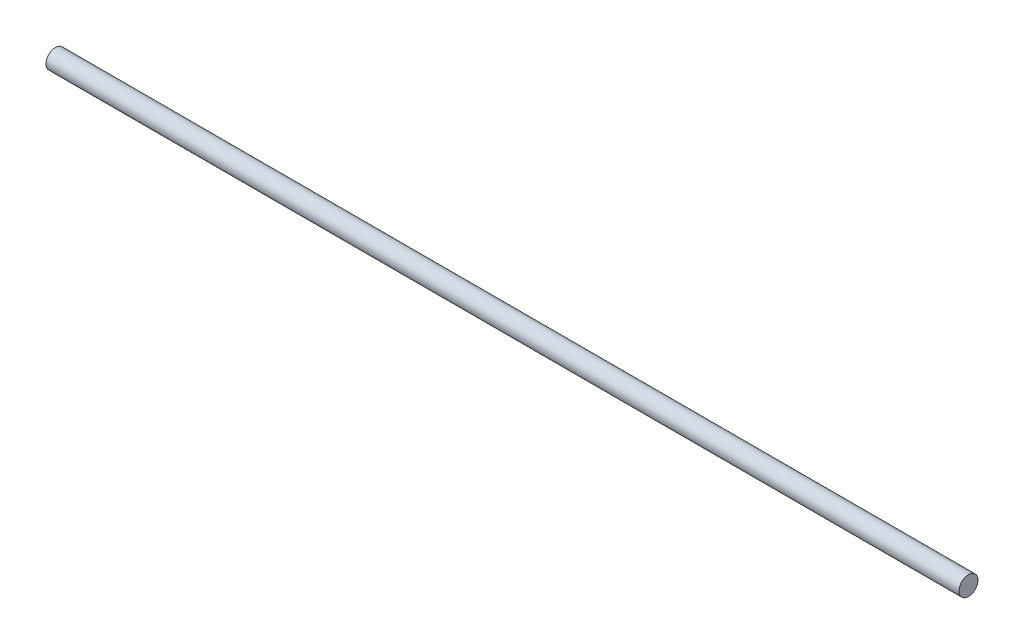
ISO-10303-21;
HEADER;
FILE_DESCRIPTION(('STEP AP214'),'2;1');
FILE_NAME('part.step','',(''),(''),'','','');
FILE_SCHEMA(('AUTOMOTIVE_DESIGN { 1 0 10303 214 1 1 1 1 }'));
ENDSEC;
DATA;
#1=APPLICATION_CONTEXT('core data for automotive mechanical design processes');
#2=APPLICATION_PROTOCOL_DEFINITION('international standard','automotive_design',2000,#1);
#3=PRODUCT_CONTEXT('',#1,'mechanical');
#4=PRODUCT('Part','Part','',(#3));
#5=PRODUCT_RELATED_PRODUCT_CATEGORY('part','',(#4));
#6=PRODUCT_DEFINITION_FORMATION('','',#4);
#7=PRODUCT_DEFINITION_CONTEXT('part definition',#1,'design');
#8=PRODUCT_DEFINITION('design','',#6,#7);
#9=PRODUCT_DEFINITION_SHAPE('','',#8);
#10=(LENGTH_UNIT() NAMED_UNIT(*) SI_UNIT(.MILLI.,.METRE.));
#11=(NAMED_UNIT(*) PLANE_ANGLE_UNIT() SI_UNIT($,.RADIAN.));
#12=(NAMED_UNIT(*) SI_UNIT($,.STERADIAN.) SOLID_ANGLE_UNIT());
#13=UNCERTAINTY_MEASURE_WITH_UNIT(LENGTH_MEASURE(1.E-05),#10,'distance_accuracy_value','');
#14=(GEOMETRIC_REPRESENTATION_CONTEXT(3) GLOBAL_UNCERTAINTY_ASSIGNED_CONTEXT((#13)) GLOBAL_UNIT_ASSIGNED_CONTEXT((#10,
#11,#12)) REPRESENTATION_CONTEXT('',''));
#15=CARTESIAN_POINT('',(0.,0.,0.));
#16=DIRECTION('',(0.,0.,1.));
#17=DIRECTION('',(1.,0.,0.));
#18=AXIS2_PLACEMENT_3D('',#15,#16,#17);
#19=CARTESIAN_POINT('',(304.8,0.,0.));
#20=DIRECTION('',(-1.,0.,0.));
#21=DIRECTION('',(0.,0.,1.));
#22=AXIS2_PLACEMENT_3D('',#19,#20,#21);
#23=CYLINDRICAL_SURFACE('',#22,3.175);
#24=CARTESIAN_POINT('',(304.8,0.,0.));
#25=DIRECTION('',(1.,0.,0.));
#26=DIRECTION('',(0.,0.,-1.));
#27=AXIS2_PLACEMENT_3D('',#24,#25,#26);
#28=CIRCLE('',#27,3.175);
#29=CARTESIAN_POINT('',(304.8,0.,-3.175));
#30=VERTEX_POINT('',#29);
#31=EDGE_CURVE('E10',#30,#30,#28,.T.);
#32=ORIENTED_EDGE('',*,*,#31,.F.);
#33=EDGE_LOOP('',(#32));
#34=FACE_BOUND('',#33,.T.);
#35=CARTESIAN_POINT('',(0.,0.,0.));
#36=DIRECTION('',(1.,0.,0.));
#37=DIRECTION('',(0.,0.,-1.));
#38=AXIS2_PLACEMENT_3D('',#35,#36,#37);
#39=CIRCLE('',#38,3.175);
#40=CARTESIAN_POINT('',(0.,0.,-3.175));
#41=VERTEX_POINT('',#40);
#42=EDGE_CURVE('E40',#41,#41,#39,.T.);
#43=ORIENTED_EDGE('',*,*,#42,.T.);
#44=EDGE_LOOP('',(#43));
#45=FACE_BOUND('',#44,.T.);
#46=ADVANCED_FACE('F37',(#34,#45),#23,.T.);
#47=CARTESIAN_POINT('',(304.8,0.,0.));
#48=DIRECTION('',(1.,0.,0.));
#49=DIRECTION('',(0.,0.,-1.));
#50=AXIS2_PLACEMENT_3D('',#47,#48,#49);
#51=PLANE('',#50);
#52=ORIENTED_EDGE('',*,*,#31,.T.);
#53=EDGE_LOOP('',(#52));
#54=FACE_BOUND('',#53,.T.);
#55=ADVANCED_FACE('F52',(#54),#51,.T.);
#56=CARTESIAN_POINT('',(0.,0.,0.));
#57=DIRECTION('',(1.,0.,0.));
#58=DIRECTION('',(0.,0.,-1.));
#59=AXIS2_PLACEMENT_3D('',#56,#57,#58);
#60=PLANE('',#59);
#61=ORIENTED_EDGE('',*,*,#42,.F.);
#62=EDGE_LOOP('',(#61));
#63=FACE_BOUND('',#62,.T.);
#64=ADVANCED_FACE('F50',(#63),#60,.F.);
#65=CLOSED_SHELL('',(#46,#55,#64));
#66=MANIFOLD_SOLID_BREP('B2',#65);
#67=ADVANCED_BREP_SHAPE_REPRESENTATION('',(#18,#66),#14);
#68=SHAPE_DEFINITION_REPRESENTATION(#9,#67);
ENDSEC;
END-ISO-10303-21;
